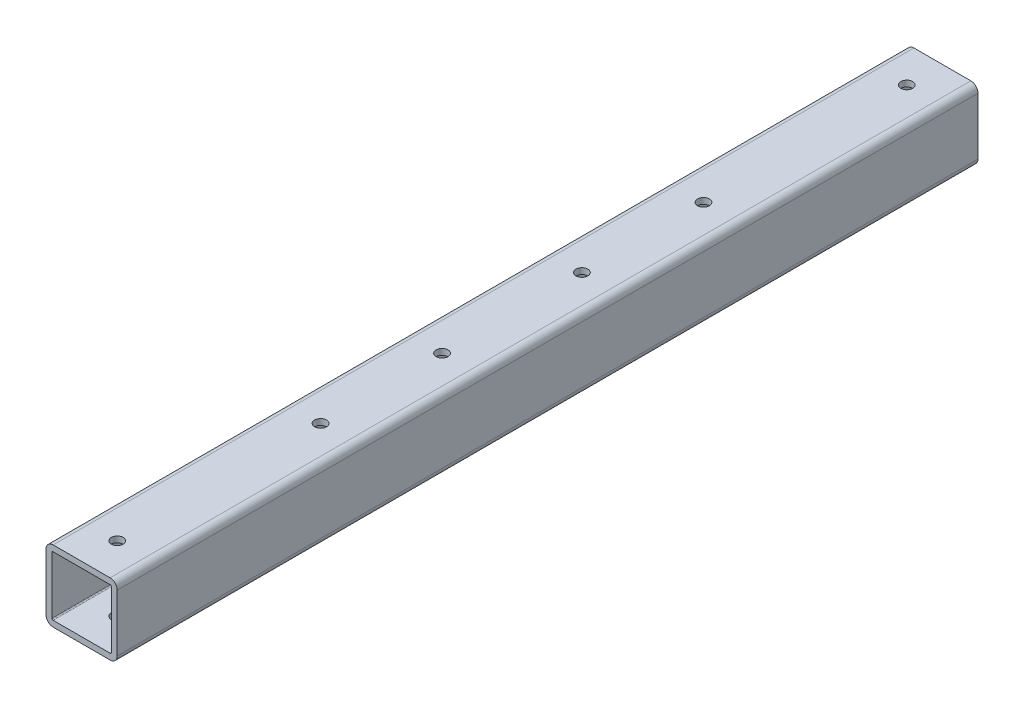
ISO-10303-21;
HEADER;
FILE_DESCRIPTION(('STEP AP214'),'2;1');
FILE_NAME('part.step','',(''),(''),'','','');
FILE_SCHEMA(('AUTOMOTIVE_DESIGN { 1 0 10303 214 1 1 1 1 }'));
ENDSEC;
DATA;
#1=APPLICATION_CONTEXT('core data for automotive mechanical design processes');
#2=APPLICATION_PROTOCOL_DEFINITION('international standard','automotive_design',2000,#1);
#3=PRODUCT_CONTEXT('',#1,'mechanical');
#4=PRODUCT('Part','Part','',(#3));
#5=PRODUCT_RELATED_PRODUCT_CATEGORY('part','',(#4));
#6=PRODUCT_DEFINITION_FORMATION('','',#4);
#7=PRODUCT_DEFINITION_CONTEXT('part definition',#1,'design');
#8=PRODUCT_DEFINITION('design','',#6,#7);
#9=PRODUCT_DEFINITION_SHAPE('','',#8);
#10=(LENGTH_UNIT() NAMED_UNIT(*) SI_UNIT(.MILLI.,.METRE.));
#11=(NAMED_UNIT(*) PLANE_ANGLE_UNIT() SI_UNIT($,.RADIAN.));
#12=(NAMED_UNIT(*) SI_UNIT($,.STERADIAN.) SOLID_ANGLE_UNIT());
#13=UNCERTAINTY_MEASURE_WITH_UNIT(LENGTH_MEASURE(1.E-05),#10,'distance_accuracy_value','');
#14=(GEOMETRIC_REPRESENTATION_CONTEXT(3) GLOBAL_UNCERTAINTY_ASSIGNED_CONTEXT((#13)) GLOBAL_UNIT_ASSIGNED_CONTEXT((#10,
#11,#12)) REPRESENTATION_CONTEXT('',''));
#15=CARTESIAN_POINT('',(0.,0.,0.));
#16=DIRECTION('',(0.,0.,1.));
#17=DIRECTION('',(1.,0.,0.));
#18=AXIS2_PLACEMENT_3D('',#15,#16,#17);
#19=CARTESIAN_POINT('',(0.,0.,230.1875));
#20=DIRECTION('',(0.,0.,1.));
#21=DIRECTION('',(1.,0.,0.));
#22=AXIS2_PLACEMENT_3D('',#19,#20,#21);
#23=PLANE('',#22);
#24=DIRECTION('',(0.,1.,0.));
#25=VECTOR('',#24,1.);
#26=CARTESIAN_POINT('',(19.05,19.05,230.1875));
#27=LINE('',#26,#25);
#28=CARTESIAN_POINT('',(19.05,-15.24,230.1875));
#29=VERTEX_POINT('',#28);
#30=CARTESIAN_POINT('',(19.05,15.24,230.1875));
#31=VERTEX_POINT('',#30);
#32=EDGE_CURVE('E207',#29,#31,#27,.T.);
#33=ORIENTED_EDGE('',*,*,#32,.T.);
#34=CARTESIAN_POINT('',(15.24,15.24,230.1875));
#35=DIRECTION('',(0.,0.,1.));
#36=DIRECTION('',(1.,0.,0.));
#37=AXIS2_PLACEMENT_3D('',#34,#35,#36);
#38=CIRCLE('',#37,3.81);
#39=CARTESIAN_POINT('',(15.24,19.05,230.1875));
#40=VERTEX_POINT('',#39);
#41=EDGE_CURVE('E232',#31,#40,#38,.T.);
#42=ORIENTED_EDGE('',*,*,#41,.T.);
#43=DIRECTION('',(-1.,0.,0.));
#44=VECTOR('',#43,1.);
#45=CARTESIAN_POINT('',(-19.05,19.05,230.1875));
#46=LINE('',#45,#44);
#47=CARTESIAN_POINT('',(-15.24,19.05,230.1875));
#48=VERTEX_POINT('',#47);
#49=EDGE_CURVE('E183',#40,#48,#46,.T.);
#50=ORIENTED_EDGE('',*,*,#49,.T.);
#51=CARTESIAN_POINT('',(-15.24,15.24,230.1875));
#52=DIRECTION('',(0.,0.,1.));
#53=DIRECTION('',(1.,0.,0.));
#54=AXIS2_PLACEMENT_3D('',#51,#52,#53);
#55=CIRCLE('',#54,3.81);
#56=CARTESIAN_POINT('',(-19.05,15.24,230.1875));
#57=VERTEX_POINT('',#56);
#58=EDGE_CURVE('E229',#48,#57,#55,.T.);
#59=ORIENTED_EDGE('',*,*,#58,.T.);
#60=DIRECTION('',(0.,-1.,0.));
#61=VECTOR('',#60,1.);
#62=CARTESIAN_POINT('',(-19.05,19.05,230.1875));
#63=LINE('',#62,#61);
#64=CARTESIAN_POINT('',(-19.05,-15.24,230.1875));
#65=VERTEX_POINT('',#64);
#66=EDGE_CURVE('E371',#57,#65,#63,.T.);
#67=ORIENTED_EDGE('',*,*,#66,.T.);
#68=CARTESIAN_POINT('',(-15.24,-15.24,230.1875));
#69=DIRECTION('',(0.,0.,1.));
#70=DIRECTION('',(1.,0.,0.));
#71=AXIS2_PLACEMENT_3D('',#68,#69,#70);
#72=CIRCLE('',#71,3.81);
#73=CARTESIAN_POINT('',(-15.24,-19.05,230.1875));
#74=VERTEX_POINT('',#73);
#75=EDGE_CURVE('E226',#65,#74,#72,.T.);
#76=ORIENTED_EDGE('',*,*,#75,.T.);
#77=DIRECTION('',(1.,0.,0.));
#78=VECTOR('',#77,1.);
#79=CARTESIAN_POINT('',(-19.05,-19.05,230.1875));
#80=LINE('',#79,#78);
#81=CARTESIAN_POINT('',(15.24,-19.05,230.1875));
#82=VERTEX_POINT('',#81);
#83=EDGE_CURVE('E209',#74,#82,#80,.T.);
#84=ORIENTED_EDGE('',*,*,#83,.T.);
#85=CARTESIAN_POINT('',(15.24,-15.24,230.1875));
#86=DIRECTION('',(0.,0.,1.));
#87=DIRECTION('',(1.,0.,0.));
#88=AXIS2_PLACEMENT_3D('',#85,#86,#87);
#89=CIRCLE('',#88,3.81);
#90=EDGE_CURVE('E223',#82,#29,#89,.T.);
#91=ORIENTED_EDGE('',*,*,#90,.T.);
#92=EDGE_LOOP('',(#33,#42,#50,#59,#67,#76,#84,#91));
#93=FACE_BOUND('',#92,.T.);
#94=DIRECTION('',(0.,-1.,0.));
#95=VECTOR('',#94,1.);
#96=CARTESIAN_POINT('',(-15.875,15.875,230.1875));
#97=LINE('',#96,#95);
#98=CARTESIAN_POINT('',(-15.875,15.24,230.1875));
#99=VERTEX_POINT('',#98);
#100=CARTESIAN_POINT('',(-15.875,-15.24,230.1875));
#101=VERTEX_POINT('',#100);
#102=EDGE_CURVE('E340',#99,#101,#97,.T.);
#103=ORIENTED_EDGE('',*,*,#102,.F.);
#104=CARTESIAN_POINT('',(-15.24,15.24,230.1875));
#105=DIRECTION('',(0.,0.,1.));
#106=DIRECTION('',(1.,0.,0.));
#107=AXIS2_PLACEMENT_3D('',#104,#105,#106);
#108=CIRCLE('',#107,0.635);
#109=CARTESIAN_POINT('',(-15.24,15.875,230.1875));
#110=VERTEX_POINT('',#109);
#111=EDGE_CURVE('E63',#99,#110,#108,.F.);
#112=ORIENTED_EDGE('',*,*,#111,.T.);
#113=DIRECTION('',(-1.,0.,0.));
#114=VECTOR('',#113,1.);
#115=CARTESIAN_POINT('',(-15.875,15.875,230.1875));
#116=LINE('',#115,#114);
#117=CARTESIAN_POINT('',(15.24,15.875,230.1875));
#118=VERTEX_POINT('',#117);
#119=EDGE_CURVE('E337',#118,#110,#116,.T.);
#120=ORIENTED_EDGE('',*,*,#119,.F.);
#121=CARTESIAN_POINT('',(15.24,15.24,230.1875));
#122=DIRECTION('',(0.,0.,1.));
#123=DIRECTION('',(1.,0.,0.));
#124=AXIS2_PLACEMENT_3D('',#121,#122,#123);
#125=CIRCLE('',#124,0.635);
#126=CARTESIAN_POINT('',(15.875,15.24,230.1875));
#127=VERTEX_POINT('',#126);
#128=EDGE_CURVE('E11',#118,#127,#125,.F.);
#129=ORIENTED_EDGE('',*,*,#128,.T.);
#130=DIRECTION('',(0.,1.,0.));
#131=VECTOR('',#130,1.);
#132=CARTESIAN_POINT('',(15.875,15.875,230.1875));
#133=LINE('',#132,#131);
#134=CARTESIAN_POINT('',(15.875,-15.24,230.1875));
#135=VERTEX_POINT('',#134);
#136=EDGE_CURVE('E200',#135,#127,#133,.T.);
#137=ORIENTED_EDGE('',*,*,#136,.F.);
#138=CARTESIAN_POINT('',(15.24,-15.24,230.1875));
#139=DIRECTION('',(0.,0.,1.));
#140=DIRECTION('',(1.,0.,0.));
#141=AXIS2_PLACEMENT_3D('',#138,#139,#140);
#142=CIRCLE('',#141,0.635);
#143=CARTESIAN_POINT('',(15.24,-15.875,230.1875));
#144=VERTEX_POINT('',#143);
#145=EDGE_CURVE('E279',#135,#144,#142,.F.);
#146=ORIENTED_EDGE('',*,*,#145,.T.);
#147=DIRECTION('',(1.,0.,0.));
#148=VECTOR('',#147,1.);
#149=CARTESIAN_POINT('',(-15.875,-15.875,230.1875));
#150=LINE('',#149,#148);
#151=CARTESIAN_POINT('',(-15.24,-15.875,230.1875));
#152=VERTEX_POINT('',#151);
#153=EDGE_CURVE('E345',#152,#144,#150,.T.);
#154=ORIENTED_EDGE('',*,*,#153,.F.);
#155=CARTESIAN_POINT('',(-15.24,-15.24,230.1875));
#156=DIRECTION('',(0.,0.,1.));
#157=DIRECTION('',(1.,0.,0.));
#158=AXIS2_PLACEMENT_3D('',#155,#156,#157);
#159=CIRCLE('',#158,0.635);
#160=EDGE_CURVE('E285',#152,#101,#159,.F.);
#161=ORIENTED_EDGE('',*,*,#160,.T.);
#162=EDGE_LOOP('',(#103,#112,#120,#129,#137,#146,#154,#161));
#163=FACE_BOUND('',#162,.T.);
#164=ADVANCED_FACE('F45',(#93,#163),#23,.T.);
#165=CARTESIAN_POINT('',(0.,0.,-230.1875));
#166=DIRECTION('',(0.,0.,1.));
#167=DIRECTION('',(1.,0.,0.));
#168=AXIS2_PLACEMENT_3D('',#165,#166,#167);
#169=PLANE('',#168);
#170=DIRECTION('',(-1.,0.,0.));
#171=VECTOR('',#170,1.);
#172=CARTESIAN_POINT('',(-19.05,19.05,-230.1875));
#173=LINE('',#172,#171);
#174=CARTESIAN_POINT('',(15.24,19.05,-230.1875));
#175=VERTEX_POINT('',#174);
#176=CARTESIAN_POINT('',(-15.24,19.05,-230.1875));
#177=VERTEX_POINT('',#176);
#178=EDGE_CURVE('E180',#175,#177,#173,.T.);
#179=ORIENTED_EDGE('',*,*,#178,.F.);
#180=CARTESIAN_POINT('',(15.24,15.24,-230.1875));
#181=DIRECTION('',(0.,0.,1.));
#182=DIRECTION('',(1.,0.,0.));
#183=AXIS2_PLACEMENT_3D('',#180,#181,#182);
#184=CIRCLE('',#183,3.81);
#185=CARTESIAN_POINT('',(19.05,15.24,-230.1875));
#186=VERTEX_POINT('',#185);
#187=EDGE_CURVE('E162',#175,#186,#184,.F.);
#188=ORIENTED_EDGE('',*,*,#187,.T.);
#189=DIRECTION('',(0.,1.,0.));
#190=VECTOR('',#189,1.);
#191=CARTESIAN_POINT('',(19.05,19.05,-230.1875));
#192=LINE('',#191,#190);
#193=CARTESIAN_POINT('',(19.05,-15.24,-230.1875));
#194=VERTEX_POINT('',#193);
#195=EDGE_CURVE('E193',#194,#186,#192,.T.);
#196=ORIENTED_EDGE('',*,*,#195,.F.);
#197=CARTESIAN_POINT('',(15.24,-15.24,-230.1875));
#198=DIRECTION('',(0.,0.,1.));
#199=DIRECTION('',(1.,0.,0.));
#200=AXIS2_PLACEMENT_3D('',#197,#198,#199);
#201=CIRCLE('',#200,3.81);
#202=CARTESIAN_POINT('',(15.24,-19.05,-230.1875));
#203=VERTEX_POINT('',#202);
#204=EDGE_CURVE('E185',#194,#203,#201,.F.);
#205=ORIENTED_EDGE('',*,*,#204,.T.);
#206=DIRECTION('',(1.,0.,0.));
#207=VECTOR('',#206,1.);
#208=CARTESIAN_POINT('',(-19.05,-19.05,-230.1875));
#209=LINE('',#208,#207);
#210=CARTESIAN_POINT('',(-15.24,-19.05,-230.1875));
#211=VERTEX_POINT('',#210);
#212=EDGE_CURVE('E198',#211,#203,#209,.T.);
#213=ORIENTED_EDGE('',*,*,#212,.F.);
#214=CARTESIAN_POINT('',(-15.24,-15.24,-230.1875));
#215=DIRECTION('',(0.,0.,1.));
#216=DIRECTION('',(1.,0.,0.));
#217=AXIS2_PLACEMENT_3D('',#214,#215,#216);
#218=CIRCLE('',#217,3.81);
#219=CARTESIAN_POINT('',(-19.05,-15.24,-230.1875));
#220=VERTEX_POINT('',#219);
#221=EDGE_CURVE('E213',#211,#220,#218,.F.);
#222=ORIENTED_EDGE('',*,*,#221,.T.);
#223=DIRECTION('',(0.,-1.,0.));
#224=VECTOR('',#223,1.);
#225=CARTESIAN_POINT('',(-19.05,19.05,-230.1875));
#226=LINE('',#225,#224);
#227=CARTESIAN_POINT('',(-19.05,15.24,-230.1875));
#228=VERTEX_POINT('',#227);
#229=EDGE_CURVE('E192',#228,#220,#226,.T.);
#230=ORIENTED_EDGE('',*,*,#229,.F.);
#231=CARTESIAN_POINT('',(-15.24,15.24,-230.1875));
#232=DIRECTION('',(0.,0.,1.));
#233=DIRECTION('',(1.,0.,0.));
#234=AXIS2_PLACEMENT_3D('',#231,#232,#233);
#235=CIRCLE('',#234,3.81);
#236=EDGE_CURVE('E174',#228,#177,#235,.F.);
#237=ORIENTED_EDGE('',*,*,#236,.T.);
#238=EDGE_LOOP('',(#179,#188,#196,#205,#213,#222,#230,#237));
#239=FACE_BOUND('',#238,.T.);
#240=DIRECTION('',(0.,1.,0.));
#241=VECTOR('',#240,1.);
#242=CARTESIAN_POINT('',(15.875,15.875,-230.1875));
#243=LINE('',#242,#241);
#244=CARTESIAN_POINT('',(15.875,-15.24,-230.1875));
#245=VERTEX_POINT('',#244);
#246=CARTESIAN_POINT('',(15.875,15.24,-230.1875));
#247=VERTEX_POINT('',#246);
#248=EDGE_CURVE('E341',#245,#247,#243,.T.);
#249=ORIENTED_EDGE('',*,*,#248,.T.);
#250=CARTESIAN_POINT('',(15.24,15.24,-230.1875));
#251=DIRECTION('',(0.,0.,1.));
#252=DIRECTION('',(1.,0.,0.));
#253=AXIS2_PLACEMENT_3D('',#250,#251,#252);
#254=CIRCLE('',#253,0.635);
#255=CARTESIAN_POINT('',(15.24,15.875,-230.1875));
#256=VERTEX_POINT('',#255);
#257=EDGE_CURVE('E55',#247,#256,#254,.T.);
#258=ORIENTED_EDGE('',*,*,#257,.T.);
#259=DIRECTION('',(-1.,0.,0.));
#260=VECTOR('',#259,1.);
#261=CARTESIAN_POINT('',(-15.875,15.875,-230.1875));
#262=LINE('',#261,#260);
#263=CARTESIAN_POINT('',(-15.24,15.875,-230.1875));
#264=VERTEX_POINT('',#263);
#265=EDGE_CURVE('E336',#256,#264,#262,.T.);
#266=ORIENTED_EDGE('',*,*,#265,.T.);
#267=CARTESIAN_POINT('',(-15.24,15.24,-230.1875));
#268=DIRECTION('',(0.,0.,1.));
#269=DIRECTION('',(1.,0.,0.));
#270=AXIS2_PLACEMENT_3D('',#267,#268,#269);
#271=CIRCLE('',#270,0.635);
#272=CARTESIAN_POINT('',(-15.875,15.24,-230.1875));
#273=VERTEX_POINT('',#272);
#274=EDGE_CURVE('E288',#264,#273,#271,.T.);
#275=ORIENTED_EDGE('',*,*,#274,.T.);
#276=DIRECTION('',(0.,-1.,0.));
#277=VECTOR('',#276,1.);
#278=CARTESIAN_POINT('',(-15.875,15.875,-230.1875));
#279=LINE('',#278,#277);
#280=CARTESIAN_POINT('',(-15.875,-15.24,-230.1875));
#281=VERTEX_POINT('',#280);
#282=EDGE_CURVE('E355',#273,#281,#279,.T.);
#283=ORIENTED_EDGE('',*,*,#282,.T.);
#284=CARTESIAN_POINT('',(-15.24,-15.24,-230.1875));
#285=DIRECTION('',(0.,0.,1.));
#286=DIRECTION('',(1.,0.,0.));
#287=AXIS2_PLACEMENT_3D('',#284,#285,#286);
#288=CIRCLE('',#287,0.635);
#289=CARTESIAN_POINT('',(-15.24,-15.875,-230.1875));
#290=VERTEX_POINT('',#289);
#291=EDGE_CURVE('E282',#281,#290,#288,.T.);
#292=ORIENTED_EDGE('',*,*,#291,.T.);
#293=DIRECTION('',(1.,0.,0.));
#294=VECTOR('',#293,1.);
#295=CARTESIAN_POINT('',(-15.875,-15.875,-230.1875));
#296=LINE('',#295,#294);
#297=CARTESIAN_POINT('',(15.24,-15.875,-230.1875));
#298=VERTEX_POINT('',#297);
#299=EDGE_CURVE('E359',#290,#298,#296,.T.);
#300=ORIENTED_EDGE('',*,*,#299,.T.);
#301=CARTESIAN_POINT('',(15.24,-15.24,-230.1875));
#302=DIRECTION('',(0.,0.,1.));
#303=DIRECTION('',(1.,0.,0.));
#304=AXIS2_PLACEMENT_3D('',#301,#302,#303);
#305=CIRCLE('',#304,0.635);
#306=EDGE_CURVE('E276',#298,#245,#305,.T.);
#307=ORIENTED_EDGE('',*,*,#306,.T.);
#308=EDGE_LOOP('',(#249,#258,#266,#275,#283,#292,#300,#307));
#309=FACE_BOUND('',#308,.T.);
#310=ADVANCED_FACE('F188',(#239,#309),#169,.F.);
#311=CARTESIAN_POINT('',(19.05,19.05,230.1875));
#312=DIRECTION('',(-1.,0.,0.));
#313=DIRECTION('',(0.,0.,1.));
#314=AXIS2_PLACEMENT_3D('',#311,#312,#313);
#315=PLANE('',#314);
#316=ORIENTED_EDGE('',*,*,#195,.T.);
#317=DIRECTION('',(0.,0.,-1.));
#318=VECTOR('',#317,1.);
#319=CARTESIAN_POINT('',(19.05,15.24,230.1875));
#320=LINE('',#319,#318);
#321=EDGE_CURVE('E167',#186,#31,#320,.F.);
#322=ORIENTED_EDGE('',*,*,#321,.T.);
#323=ORIENTED_EDGE('',*,*,#32,.F.);
#324=DIRECTION('',(0.,0.,-1.));
#325=VECTOR('',#324,1.);
#326=CARTESIAN_POINT('',(19.05,-15.24,230.1875));
#327=LINE('',#326,#325);
#328=EDGE_CURVE('E173',#29,#194,#327,.T.);
#329=ORIENTED_EDGE('',*,*,#328,.T.);
#330=EDGE_LOOP('',(#316,#322,#323,#329));
#331=FACE_BOUND('',#330,.T.);
#332=ADVANCED_FACE('F388',(#331),#315,.F.);
#333=CARTESIAN_POINT('',(-19.05,19.05,230.1875));
#334=DIRECTION('',(0.,-1.,0.));
#335=DIRECTION('',(0.,0.,-1.));
#336=AXIS2_PLACEMENT_3D('',#333,#334,#335);
#337=PLANE('',#336);
#338=CARTESIAN_POINT('',(0.,19.05,211.1375));
#339=DIRECTION('',(0.,1.,0.));
#340=DIRECTION('',(0.,0.,1.));
#341=AXIS2_PLACEMENT_3D('',#338,#339,#340);
#342=CIRCLE('',#341,3.175);
#343=CARTESIAN_POINT('',(0.,19.05,214.3125));
#344=VERTEX_POINT('',#343);
#345=EDGE_CURVE('E716',#344,#344,#342,.T.);
#346=ORIENTED_EDGE('',*,*,#345,.F.);
#347=EDGE_LOOP('',(#346));
#348=FACE_BOUND('',#347,.T.);
#349=CARTESIAN_POINT('',(0.,19.05,102.4));
#350=DIRECTION('',(0.,1.,0.));
#351=DIRECTION('',(0.,0.,1.));
#352=AXIS2_PLACEMENT_3D('',#349,#350,#351);
#353=CIRCLE('',#352,3.175);
#354=CARTESIAN_POINT('',(0.,19.05,105.575));
#355=VERTEX_POINT('',#354);
#356=EDGE_CURVE('E712',#355,#355,#353,.T.);
#357=ORIENTED_EDGE('',*,*,#356,.F.);
#358=EDGE_LOOP('',(#357));
#359=FACE_BOUND('',#358,.T.);
#360=CARTESIAN_POINT('',(0.,19.05,37.4));
#361=DIRECTION('',(0.,1.,0.));
#362=DIRECTION('',(0.,0.,1.));
#363=AXIS2_PLACEMENT_3D('',#360,#361,#362);
#364=CIRCLE('',#363,3.175);
#365=CARTESIAN_POINT('',(0.,19.05,40.575));
#366=VERTEX_POINT('',#365);
#367=EDGE_CURVE('E704',#366,#366,#364,.T.);
#368=ORIENTED_EDGE('',*,*,#367,.F.);
#369=EDGE_LOOP('',(#368));
#370=FACE_BOUND('',#369,.T.);
#371=CARTESIAN_POINT('',(0.,19.05,-37.4));
#372=DIRECTION('',(0.,1.,0.));
#373=DIRECTION('',(0.,0.,1.));
#374=AXIS2_PLACEMENT_3D('',#371,#372,#373);
#375=CIRCLE('',#374,3.175);
#376=CARTESIAN_POINT('',(0.,19.05,-34.225));
#377=VERTEX_POINT('',#376);
#378=EDGE_CURVE('E684',#377,#377,#375,.T.);
#379=ORIENTED_EDGE('',*,*,#378,.F.);
#380=EDGE_LOOP('',(#379));
#381=FACE_BOUND('',#380,.T.);
#382=CARTESIAN_POINT('',(0.,19.05,-102.4));
#383=DIRECTION('',(0.,1.,0.));
#384=DIRECTION('',(0.,0.,1.));
#385=AXIS2_PLACEMENT_3D('',#382,#383,#384);
#386=CIRCLE('',#385,3.175);
#387=CARTESIAN_POINT('',(0.,19.05,-99.225));
#388=VERTEX_POINT('',#387);
#389=EDGE_CURVE('E675',#388,#388,#386,.T.);
#390=ORIENTED_EDGE('',*,*,#389,.F.);
#391=EDGE_LOOP('',(#390));
#392=FACE_BOUND('',#391,.T.);
#393=CARTESIAN_POINT('',(0.,19.05,-211.1375));
#394=DIRECTION('',(0.,1.,0.));
#395=DIRECTION('',(0.,0.,1.));
#396=AXIS2_PLACEMENT_3D('',#393,#394,#395);
#397=CIRCLE('',#396,3.175);
#398=CARTESIAN_POINT('',(0.,19.05,-207.9625));
#399=VERTEX_POINT('',#398);
#400=EDGE_CURVE('E669',#399,#399,#397,.T.);
#401=ORIENTED_EDGE('',*,*,#400,.F.);
#402=EDGE_LOOP('',(#401));
#403=FACE_BOUND('',#402,.T.);
#404=ORIENTED_EDGE('',*,*,#49,.F.);
#405=DIRECTION('',(0.,0.,-1.));
#406=VECTOR('',#405,1.);
#407=CARTESIAN_POINT('',(15.24,19.05,230.1875));
#408=LINE('',#407,#406);
#409=EDGE_CURVE('E166',#40,#175,#408,.T.);
#410=ORIENTED_EDGE('',*,*,#409,.T.);
#411=ORIENTED_EDGE('',*,*,#178,.T.);
#412=DIRECTION('',(0.,0.,-1.));
#413=VECTOR('',#412,1.);
#414=CARTESIAN_POINT('',(-15.24,19.05,230.1875));
#415=LINE('',#414,#413);
#416=EDGE_CURVE('E186',#177,#48,#415,.F.);
#417=ORIENTED_EDGE('',*,*,#416,.T.);
#418=EDGE_LOOP('',(#404,#410,#411,#417));
#419=FACE_BOUND('',#418,.T.);
#420=ADVANCED_FACE('F179',(#348,#359,#370,#381,#392,#403,#419),#337,.F.);
#421=CARTESIAN_POINT('',(-19.05,19.05,230.1875));
#422=DIRECTION('',(1.,0.,0.));
#423=DIRECTION('',(0.,0.,-1.));
#424=AXIS2_PLACEMENT_3D('',#421,#422,#423);
#425=PLANE('',#424);
#426=ORIENTED_EDGE('',*,*,#66,.F.);
#427=DIRECTION('',(0.,0.,-1.));
#428=VECTOR('',#427,1.);
#429=CARTESIAN_POINT('',(-19.05,15.24,230.1875));
#430=LINE('',#429,#428);
#431=EDGE_CURVE('E238',#57,#228,#430,.T.);
#432=ORIENTED_EDGE('',*,*,#431,.T.);
#433=ORIENTED_EDGE('',*,*,#229,.T.);
#434=DIRECTION('',(0.,0.,-1.));
#435=VECTOR('',#434,1.);
#436=CARTESIAN_POINT('',(-19.05,-15.24,230.1875));
#437=LINE('',#436,#435);
#438=EDGE_CURVE('E235',#220,#65,#437,.F.);
#439=ORIENTED_EDGE('',*,*,#438,.T.);
#440=EDGE_LOOP('',(#426,#432,#433,#439));
#441=FACE_BOUND('',#440,.T.);
#442=ADVANCED_FACE('F396',(#441),#425,.F.);
#443=CARTESIAN_POINT('',(-19.05,-19.05,230.1875));
#444=DIRECTION('',(0.,1.,0.));
#445=DIRECTION('',(0.,0.,1.));
#446=AXIS2_PLACEMENT_3D('',#443,#444,#445);
#447=PLANE('',#446);
#448=CARTESIAN_POINT('',(0.,-19.05,211.1375));
#449=DIRECTION('',(0.,1.,0.));
#450=DIRECTION('',(0.,0.,1.));
#451=AXIS2_PLACEMENT_3D('',#448,#449,#450);
#452=CIRCLE('',#451,3.175);
#453=CARTESIAN_POINT('',(0.,-19.05,214.3125));
#454=VERTEX_POINT('',#453);
#455=EDGE_CURVE('E300',#454,#454,#452,.T.);
#456=ORIENTED_EDGE('',*,*,#455,.T.);
#457=EDGE_LOOP('',(#456));
#458=FACE_BOUND('',#457,.T.);
#459=CARTESIAN_POINT('',(0.,-19.05,102.4));
#460=DIRECTION('',(0.,1.,0.));
#461=DIRECTION('',(0.,0.,1.));
#462=AXIS2_PLACEMENT_3D('',#459,#460,#461);
#463=CIRCLE('',#462,3.175);
#464=CARTESIAN_POINT('',(0.,-19.05,105.575));
#465=VERTEX_POINT('',#464);
#466=EDGE_CURVE('E708',#465,#465,#463,.T.);
#467=ORIENTED_EDGE('',*,*,#466,.T.);
#468=EDGE_LOOP('',(#467));
#469=FACE_BOUND('',#468,.T.);
#470=CARTESIAN_POINT('',(0.,-19.05,37.4));
#471=DIRECTION('',(0.,1.,0.));
#472=DIRECTION('',(0.,0.,1.));
#473=AXIS2_PLACEMENT_3D('',#470,#471,#472);
#474=CIRCLE('',#473,3.175);
#475=CARTESIAN_POINT('',(0.,-19.05,40.575));
#476=VERTEX_POINT('',#475);
#477=EDGE_CURVE('E702',#476,#476,#474,.T.);
#478=ORIENTED_EDGE('',*,*,#477,.T.);
#479=EDGE_LOOP('',(#478));
#480=FACE_BOUND('',#479,.T.);
#481=CARTESIAN_POINT('',(0.,-19.05,-37.4));
#482=DIRECTION('',(0.,1.,0.));
#483=DIRECTION('',(0.,0.,1.));
#484=AXIS2_PLACEMENT_3D('',#481,#482,#483);
#485=CIRCLE('',#484,3.175);
#486=CARTESIAN_POINT('',(0.,-19.05,-34.225));
#487=VERTEX_POINT('',#486);
#488=EDGE_CURVE('E678',#487,#487,#485,.T.);
#489=ORIENTED_EDGE('',*,*,#488,.T.);
#490=EDGE_LOOP('',(#489));
#491=FACE_BOUND('',#490,.T.);
#492=CARTESIAN_POINT('',(0.,-19.05,-102.4));
#493=DIRECTION('',(0.,1.,0.));
#494=DIRECTION('',(0.,0.,1.));
#495=AXIS2_PLACEMENT_3D('',#492,#493,#494);
#496=CIRCLE('',#495,3.175);
#497=CARTESIAN_POINT('',(0.,-19.05,-99.225));
#498=VERTEX_POINT('',#497);
#499=EDGE_CURVE('E679',#498,#498,#496,.T.);
#500=ORIENTED_EDGE('',*,*,#499,.T.);
#501=EDGE_LOOP('',(#500));
#502=FACE_BOUND('',#501,.T.);
#503=CARTESIAN_POINT('',(0.,-19.05,-211.1375));
#504=DIRECTION('',(0.,1.,0.));
#505=DIRECTION('',(0.,0.,1.));
#506=AXIS2_PLACEMENT_3D('',#503,#504,#505);
#507=CIRCLE('',#506,3.175);
#508=CARTESIAN_POINT('',(0.,-19.05,-207.9625));
#509=VERTEX_POINT('',#508);
#510=EDGE_CURVE('E689',#509,#509,#507,.T.);
#511=ORIENTED_EDGE('',*,*,#510,.T.);
#512=EDGE_LOOP('',(#511));
#513=FACE_BOUND('',#512,.T.);
#514=ORIENTED_EDGE('',*,*,#83,.F.);
#515=DIRECTION('',(0.,0.,-1.));
#516=VECTOR('',#515,1.);
#517=CARTESIAN_POINT('',(-15.24,-19.05,230.1875));
#518=LINE('',#517,#516);
#519=EDGE_CURVE('E245',#74,#211,#518,.T.);
#520=ORIENTED_EDGE('',*,*,#519,.T.);
#521=ORIENTED_EDGE('',*,*,#212,.T.);
#522=DIRECTION('',(0.,0.,-1.));
#523=VECTOR('',#522,1.);
#524=CARTESIAN_POINT('',(15.24,-19.05,230.1875));
#525=LINE('',#524,#523);
#526=EDGE_CURVE('E242',#203,#82,#525,.F.);
#527=ORIENTED_EDGE('',*,*,#526,.T.);
#528=EDGE_LOOP('',(#514,#520,#521,#527));
#529=FACE_BOUND('',#528,.T.);
#530=ADVANCED_FACE('F390',(#458,#469,#480,#491,#502,#513,#529),#447,.F.);
#531=CARTESIAN_POINT('',(-15.875,15.875,230.1875));
#532=DIRECTION('',(0.,-1.,0.));
#533=DIRECTION('',(1.,0.,0.));
#534=AXIS2_PLACEMENT_3D('',#531,#532,#533);
#535=PLANE('',#534);
#536=CARTESIAN_POINT('',(0.,15.875,211.1375));
#537=DIRECTION('',(0.,-1.,0.));
#538=DIRECTION('',(1.,0.,0.));
#539=AXIS2_PLACEMENT_3D('',#536,#537,#538);
#540=CIRCLE('',#539,3.175);
#541=CARTESIAN_POINT('',(3.175,15.875,211.1375));
#542=VERTEX_POINT('',#541);
#543=EDGE_CURVE('E332',#542,#542,#540,.T.);
#544=ORIENTED_EDGE('',*,*,#543,.F.);
#545=EDGE_LOOP('',(#544));
#546=FACE_BOUND('',#545,.T.);
#547=CARTESIAN_POINT('',(0.,15.875,102.4));
#548=DIRECTION('',(0.,-1.,0.));
#549=DIRECTION('',(1.,0.,0.));
#550=AXIS2_PLACEMENT_3D('',#547,#548,#549);
#551=CIRCLE('',#550,3.175);
#552=CARTESIAN_POINT('',(3.175,15.875,102.4));
#553=VERTEX_POINT('',#552);
#554=EDGE_CURVE('E318',#553,#553,#551,.T.);
#555=ORIENTED_EDGE('',*,*,#554,.F.);
#556=EDGE_LOOP('',(#555));
#557=FACE_BOUND('',#556,.T.);
#558=CARTESIAN_POINT('',(0.,15.875,37.4));
#559=DIRECTION('',(0.,-1.,0.));
#560=DIRECTION('',(1.,0.,0.));
#561=AXIS2_PLACEMENT_3D('',#558,#559,#560);
#562=CIRCLE('',#561,3.175);
#563=CARTESIAN_POINT('',(3.175,15.875,37.4));
#564=VERTEX_POINT('',#563);
#565=EDGE_CURVE('E314',#564,#564,#562,.T.);
#566=ORIENTED_EDGE('',*,*,#565,.F.);
#567=EDGE_LOOP('',(#566));
#568=FACE_BOUND('',#567,.T.);
#569=CARTESIAN_POINT('',(0.,15.875,-37.4));
#570=DIRECTION('',(0.,-1.,0.));
#571=DIRECTION('',(1.,0.,0.));
#572=AXIS2_PLACEMENT_3D('',#569,#570,#571);
#573=CIRCLE('',#572,3.175);
#574=CARTESIAN_POINT('',(3.175,15.875,-37.4));
#575=VERTEX_POINT('',#574);
#576=EDGE_CURVE('E310',#575,#575,#573,.T.);
#577=ORIENTED_EDGE('',*,*,#576,.F.);
#578=EDGE_LOOP('',(#577));
#579=FACE_BOUND('',#578,.T.);
#580=CARTESIAN_POINT('',(0.,15.875,-102.4));
#581=DIRECTION('',(0.,-1.,0.));
#582=DIRECTION('',(1.,0.,0.));
#583=AXIS2_PLACEMENT_3D('',#580,#581,#582);
#584=CIRCLE('',#583,3.175);
#585=CARTESIAN_POINT('',(3.175,15.875,-102.4));
#586=VERTEX_POINT('',#585);
#587=EDGE_CURVE('E305',#586,#586,#584,.T.);
#588=ORIENTED_EDGE('',*,*,#587,.F.);
#589=EDGE_LOOP('',(#588));
#590=FACE_BOUND('',#589,.T.);
#591=CARTESIAN_POINT('',(0.,15.875,-211.1375));
#592=DIRECTION('',(0.,-1.,0.));
#593=DIRECTION('',(1.,0.,0.));
#594=AXIS2_PLACEMENT_3D('',#591,#592,#593);
#595=CIRCLE('',#594,3.175);
#596=CARTESIAN_POINT('',(3.175,15.875,-211.1375));
#597=VERTEX_POINT('',#596);
#598=EDGE_CURVE('E299',#597,#597,#595,.T.);
#599=ORIENTED_EDGE('',*,*,#598,.F.);
#600=EDGE_LOOP('',(#599));
#601=FACE_BOUND('',#600,.T.);
#602=ORIENTED_EDGE('',*,*,#119,.T.);
#603=DIRECTION('',(0.,0.,-1.));
#604=VECTOR('',#603,1.);
#605=CARTESIAN_POINT('',(-15.24,15.875,-230.1875));
#606=LINE('',#605,#604);
#607=EDGE_CURVE('E272',#110,#264,#606,.T.);
#608=ORIENTED_EDGE('',*,*,#607,.T.);
#609=ORIENTED_EDGE('',*,*,#265,.F.);
#610=DIRECTION('',(0.,0.,-1.));
#611=VECTOR('',#610,1.);
#612=CARTESIAN_POINT('',(15.24,15.875,230.1875));
#613=LINE('',#612,#611);
#614=EDGE_CURVE('E70',#256,#118,#613,.F.);
#615=ORIENTED_EDGE('',*,*,#614,.T.);
#616=EDGE_LOOP('',(#602,#608,#609,#615));
#617=FACE_BOUND('',#616,.T.);
#618=ADVANCED_FACE('F418',(#546,#557,#568,#579,#590,#601,#617),#535,.T.);
#619=CARTESIAN_POINT('',(-15.875,15.875,230.1875));
#620=DIRECTION('',(1.,0.,0.));
#621=DIRECTION('',(0.,1.,0.));
#622=AXIS2_PLACEMENT_3D('',#619,#620,#621);
#623=PLANE('',#622);
#624=ORIENTED_EDGE('',*,*,#102,.T.);
#625=DIRECTION('',(0.,0.,-1.));
#626=VECTOR('',#625,1.);
#627=CARTESIAN_POINT('',(-15.875,-15.24,-230.1875));
#628=LINE('',#627,#626);
#629=EDGE_CURVE('E266',#101,#281,#628,.T.);
#630=ORIENTED_EDGE('',*,*,#629,.T.);
#631=ORIENTED_EDGE('',*,*,#282,.F.);
#632=DIRECTION('',(0.,0.,-1.));
#633=VECTOR('',#632,1.);
#634=CARTESIAN_POINT('',(-15.875,15.24,230.1875));
#635=LINE('',#634,#633);
#636=EDGE_CURVE('E263',#273,#99,#635,.F.);
#637=ORIENTED_EDGE('',*,*,#636,.T.);
#638=EDGE_LOOP('',(#624,#630,#631,#637));
#639=FACE_BOUND('',#638,.T.);
#640=ADVANCED_FACE('F627',(#639),#623,.T.);
#641=CARTESIAN_POINT('',(-15.875,-15.875,230.1875));
#642=DIRECTION('',(0.,1.,0.));
#643=DIRECTION('',(-1.,0.,0.));
#644=AXIS2_PLACEMENT_3D('',#641,#642,#643);
#645=PLANE('',#644);
#646=CARTESIAN_POINT('',(0.,-15.875,211.1375));
#647=DIRECTION('',(0.,1.,0.));
#648=DIRECTION('',(-1.,0.,0.));
#649=AXIS2_PLACEMENT_3D('',#646,#647,#648);
#650=CIRCLE('',#649,3.175);
#651=CARTESIAN_POINT('',(-3.175,-15.875,211.1375));
#652=VERTEX_POINT('',#651);
#653=EDGE_CURVE('E49',#652,#652,#650,.T.);
#654=ORIENTED_EDGE('',*,*,#653,.F.);
#655=EDGE_LOOP('',(#654));
#656=FACE_BOUND('',#655,.T.);
#657=CARTESIAN_POINT('',(0.,-15.875,102.4));
#658=DIRECTION('',(0.,1.,0.));
#659=DIRECTION('',(-1.,0.,0.));
#660=AXIS2_PLACEMENT_3D('',#657,#658,#659);
#661=CIRCLE('',#660,3.175);
#662=CARTESIAN_POINT('',(-3.175,-15.875,102.4));
#663=VERTEX_POINT('',#662);
#664=EDGE_CURVE('E315',#663,#663,#661,.T.);
#665=ORIENTED_EDGE('',*,*,#664,.F.);
#666=EDGE_LOOP('',(#665));
#667=FACE_BOUND('',#666,.T.);
#668=CARTESIAN_POINT('',(0.,-15.875,37.4));
#669=DIRECTION('',(0.,1.,0.));
#670=DIRECTION('',(-1.,0.,0.));
#671=AXIS2_PLACEMENT_3D('',#668,#669,#670);
#672=CIRCLE('',#671,3.175);
#673=CARTESIAN_POINT('',(-3.175,-15.875,37.4));
#674=VERTEX_POINT('',#673);
#675=EDGE_CURVE('E311',#674,#674,#672,.T.);
#676=ORIENTED_EDGE('',*,*,#675,.F.);
#677=EDGE_LOOP('',(#676));
#678=FACE_BOUND('',#677,.T.);
#679=CARTESIAN_POINT('',(0.,-15.875,-37.4));
#680=DIRECTION('',(0.,1.,0.));
#681=DIRECTION('',(-1.,0.,0.));
#682=AXIS2_PLACEMENT_3D('',#679,#680,#681);
#683=CIRCLE('',#682,3.175);
#684=CARTESIAN_POINT('',(-3.175,-15.875,-37.4));
#685=VERTEX_POINT('',#684);
#686=EDGE_CURVE('E306',#685,#685,#683,.T.);
#687=ORIENTED_EDGE('',*,*,#686,.F.);
#688=EDGE_LOOP('',(#687));
#689=FACE_BOUND('',#688,.T.);
#690=CARTESIAN_POINT('',(0.,-15.875,-102.4));
#691=DIRECTION('',(0.,1.,0.));
#692=DIRECTION('',(-1.,0.,0.));
#693=AXIS2_PLACEMENT_3D('',#690,#691,#692);
#694=CIRCLE('',#693,3.175);
#695=CARTESIAN_POINT('',(-3.175,-15.875,-102.4));
#696=VERTEX_POINT('',#695);
#697=EDGE_CURVE('E301',#696,#696,#694,.T.);
#698=ORIENTED_EDGE('',*,*,#697,.F.);
#699=EDGE_LOOP('',(#698));
#700=FACE_BOUND('',#699,.T.);
#701=CARTESIAN_POINT('',(0.,-15.875,-211.1375));
#702=DIRECTION('',(0.,1.,0.));
#703=DIRECTION('',(-1.,0.,0.));
#704=AXIS2_PLACEMENT_3D('',#701,#702,#703);
#705=CIRCLE('',#704,3.175);
#706=CARTESIAN_POINT('',(-3.175,-15.875,-211.1375));
#707=VERTEX_POINT('',#706);
#708=EDGE_CURVE('E295',#707,#707,#705,.T.);
#709=ORIENTED_EDGE('',*,*,#708,.F.);
#710=EDGE_LOOP('',(#709));
#711=FACE_BOUND('',#710,.T.);
#712=ORIENTED_EDGE('',*,*,#153,.T.);
#713=DIRECTION('',(0.,0.,-1.));
#714=VECTOR('',#713,1.);
#715=CARTESIAN_POINT('',(15.24,-15.875,-230.1875));
#716=LINE('',#715,#714);
#717=EDGE_CURVE('E252',#144,#298,#716,.T.);
#718=ORIENTED_EDGE('',*,*,#717,.T.);
#719=ORIENTED_EDGE('',*,*,#299,.F.);
#720=DIRECTION('',(0.,0.,-1.));
#721=VECTOR('',#720,1.);
#722=CARTESIAN_POINT('',(-15.24,-15.875,230.1875));
#723=LINE('',#722,#721);
#724=EDGE_CURVE('E249',#290,#152,#723,.F.);
#725=ORIENTED_EDGE('',*,*,#724,.T.);
#726=EDGE_LOOP('',(#712,#718,#719,#725));
#727=FACE_BOUND('',#726,.T.);
#728=ADVANCED_FACE('F625',(#656,#667,#678,#689,#700,#711,#727),#645,.T.);
#729=CARTESIAN_POINT('',(15.875,15.875,230.1875));
#730=DIRECTION('',(-1.,0.,0.));
#731=DIRECTION('',(0.,0.,1.));
#732=AXIS2_PLACEMENT_3D('',#729,#730,#731);
#733=PLANE('',#732);
#734=ORIENTED_EDGE('',*,*,#248,.F.);
#735=DIRECTION('',(0.,0.,-1.));
#736=VECTOR('',#735,1.);
#737=CARTESIAN_POINT('',(15.875,-15.24,230.1875));
#738=LINE('',#737,#736);
#739=EDGE_CURVE('E260',#245,#135,#738,.F.);
#740=ORIENTED_EDGE('',*,*,#739,.T.);
#741=ORIENTED_EDGE('',*,*,#136,.T.);
#742=DIRECTION('',(0.,0.,-1.));
#743=VECTOR('',#742,1.);
#744=CARTESIAN_POINT('',(15.875,15.24,-230.1875));
#745=LINE('',#744,#743);
#746=EDGE_CURVE('E256',#127,#247,#745,.T.);
#747=ORIENTED_EDGE('',*,*,#746,.T.);
#748=EDGE_LOOP('',(#734,#740,#741,#747));
#749=FACE_BOUND('',#748,.T.);
#750=ADVANCED_FACE('F408',(#749),#733,.T.);
#751=CARTESIAN_POINT('',(15.24,15.24,230.1875));
#752=DIRECTION('',(0.,0.,-1.));
#753=DIRECTION('',(-1.,0.,0.));
#754=AXIS2_PLACEMENT_3D('',#751,#752,#753);
#755=CYLINDRICAL_SURFACE('',#754,3.81);
#756=ORIENTED_EDGE('',*,*,#41,.F.);
#757=ORIENTED_EDGE('',*,*,#321,.F.);
#758=ORIENTED_EDGE('',*,*,#187,.F.);
#759=ORIENTED_EDGE('',*,*,#409,.F.);
#760=EDGE_LOOP('',(#756,#757,#758,#759));
#761=FACE_BOUND('',#760,.T.);
#762=ADVANCED_FACE('F165',(#761),#755,.T.);
#763=CARTESIAN_POINT('',(-15.24,15.24,230.1875));
#764=DIRECTION('',(0.,0.,-1.));
#765=DIRECTION('',(-1.,0.,0.));
#766=AXIS2_PLACEMENT_3D('',#763,#764,#765);
#767=CYLINDRICAL_SURFACE('',#766,3.81);
#768=ORIENTED_EDGE('',*,*,#58,.F.);
#769=ORIENTED_EDGE('',*,*,#416,.F.);
#770=ORIENTED_EDGE('',*,*,#236,.F.);
#771=ORIENTED_EDGE('',*,*,#431,.F.);
#772=EDGE_LOOP('',(#768,#769,#770,#771));
#773=FACE_BOUND('',#772,.T.);
#774=ADVANCED_FACE('F400',(#773),#767,.T.);
#775=CARTESIAN_POINT('',(-15.24,-15.24,230.1875));
#776=DIRECTION('',(0.,0.,-1.));
#777=DIRECTION('',(-1.,0.,0.));
#778=AXIS2_PLACEMENT_3D('',#775,#776,#777);
#779=CYLINDRICAL_SURFACE('',#778,3.81);
#780=ORIENTED_EDGE('',*,*,#75,.F.);
#781=ORIENTED_EDGE('',*,*,#438,.F.);
#782=ORIENTED_EDGE('',*,*,#221,.F.);
#783=ORIENTED_EDGE('',*,*,#519,.F.);
#784=EDGE_LOOP('',(#780,#781,#782,#783));
#785=FACE_BOUND('',#784,.T.);
#786=ADVANCED_FACE('F392',(#785),#779,.T.);
#787=CARTESIAN_POINT('',(15.24,-15.24,230.1875));
#788=DIRECTION('',(0.,0.,-1.));
#789=DIRECTION('',(-1.,0.,0.));
#790=AXIS2_PLACEMENT_3D('',#787,#788,#789);
#791=CYLINDRICAL_SURFACE('',#790,3.81);
#792=ORIENTED_EDGE('',*,*,#90,.F.);
#793=ORIENTED_EDGE('',*,*,#526,.F.);
#794=ORIENTED_EDGE('',*,*,#204,.F.);
#795=ORIENTED_EDGE('',*,*,#328,.F.);
#796=EDGE_LOOP('',(#792,#793,#794,#795));
#797=FACE_BOUND('',#796,.T.);
#798=ADVANCED_FACE('F386',(#797),#791,.T.);
#799=CARTESIAN_POINT('',(15.24,-15.24,230.1875));
#800=DIRECTION('',(0.,0.,1.));
#801=DIRECTION('',(1.,0.,0.));
#802=AXIS2_PLACEMENT_3D('',#799,#800,#801);
#803=CYLINDRICAL_SURFACE('',#802,0.635);
#804=ORIENTED_EDGE('',*,*,#145,.F.);
#805=ORIENTED_EDGE('',*,*,#739,.F.);
#806=ORIENTED_EDGE('',*,*,#306,.F.);
#807=ORIENTED_EDGE('',*,*,#717,.F.);
#808=EDGE_LOOP('',(#804,#805,#806,#807));
#809=FACE_BOUND('',#808,.T.);
#810=ADVANCED_FACE('F470',(#809),#803,.F.);
#811=CARTESIAN_POINT('',(-15.24,-15.24,230.1875));
#812=DIRECTION('',(0.,0.,1.));
#813=DIRECTION('',(1.,0.,0.));
#814=AXIS2_PLACEMENT_3D('',#811,#812,#813);
#815=CYLINDRICAL_SURFACE('',#814,0.635);
#816=ORIENTED_EDGE('',*,*,#160,.F.);
#817=ORIENTED_EDGE('',*,*,#724,.F.);
#818=ORIENTED_EDGE('',*,*,#291,.F.);
#819=ORIENTED_EDGE('',*,*,#629,.F.);
#820=EDGE_LOOP('',(#816,#817,#818,#819));
#821=FACE_BOUND('',#820,.T.);
#822=ADVANCED_FACE('F479',(#821),#815,.F.);
#823=CARTESIAN_POINT('',(-15.24,15.24,230.1875));
#824=DIRECTION('',(0.,0.,1.));
#825=DIRECTION('',(1.,0.,0.));
#826=AXIS2_PLACEMENT_3D('',#823,#824,#825);
#827=CYLINDRICAL_SURFACE('',#826,0.635);
#828=ORIENTED_EDGE('',*,*,#111,.F.);
#829=ORIENTED_EDGE('',*,*,#636,.F.);
#830=ORIENTED_EDGE('',*,*,#274,.F.);
#831=ORIENTED_EDGE('',*,*,#607,.F.);
#832=EDGE_LOOP('',(#828,#829,#830,#831));
#833=FACE_BOUND('',#832,.T.);
#834=ADVANCED_FACE('F489',(#833),#827,.F.);
#835=CARTESIAN_POINT('',(15.24,15.24,230.1875));
#836=DIRECTION('',(0.,0.,1.));
#837=DIRECTION('',(1.,0.,0.));
#838=AXIS2_PLACEMENT_3D('',#835,#836,#837);
#839=CYLINDRICAL_SURFACE('',#838,0.635);
#840=ORIENTED_EDGE('',*,*,#128,.F.);
#841=ORIENTED_EDGE('',*,*,#614,.F.);
#842=ORIENTED_EDGE('',*,*,#257,.F.);
#843=ORIENTED_EDGE('',*,*,#746,.F.);
#844=EDGE_LOOP('',(#840,#841,#842,#843));
#845=FACE_BOUND('',#844,.T.);
#846=ADVANCED_FACE('F47',(#845),#839,.F.);
#847=CARTESIAN_POINT('',(0.,-19.05,-211.1375));
#848=DIRECTION('',(0.,1.,0.));
#849=DIRECTION('',(0.,0.,1.));
#850=AXIS2_PLACEMENT_3D('',#847,#848,#849);
#851=CYLINDRICAL_SURFACE('',#850,3.175);
#852=ORIENTED_EDGE('',*,*,#708,.T.);
#853=EDGE_LOOP('',(#852));
#854=FACE_BOUND('',#853,.T.);
#855=ORIENTED_EDGE('',*,*,#510,.F.);
#856=EDGE_LOOP('',(#855));
#857=FACE_BOUND('',#856,.T.);
#858=ADVANCED_FACE('F507',(#854,#857),#851,.F.);
#859=CARTESIAN_POINT('',(0.,-19.05,-102.4));
#860=DIRECTION('',(0.,1.,0.));
#861=DIRECTION('',(0.,0.,1.));
#862=AXIS2_PLACEMENT_3D('',#859,#860,#861);
#863=CYLINDRICAL_SURFACE('',#862,3.175);
#864=ORIENTED_EDGE('',*,*,#697,.T.);
#865=EDGE_LOOP('',(#864));
#866=FACE_BOUND('',#865,.T.);
#867=ORIENTED_EDGE('',*,*,#499,.F.);
#868=EDGE_LOOP('',(#867));
#869=FACE_BOUND('',#868,.T.);
#870=ADVANCED_FACE('F516',(#866,#869),#863,.F.);
#871=CARTESIAN_POINT('',(0.,-19.05,-37.4));
#872=DIRECTION('',(0.,1.,0.));
#873=DIRECTION('',(0.,0.,1.));
#874=AXIS2_PLACEMENT_3D('',#871,#872,#873);
#875=CYLINDRICAL_SURFACE('',#874,3.175);
#876=ORIENTED_EDGE('',*,*,#686,.T.);
#877=EDGE_LOOP('',(#876));
#878=FACE_BOUND('',#877,.T.);
#879=ORIENTED_EDGE('',*,*,#488,.F.);
#880=EDGE_LOOP('',(#879));
#881=FACE_BOUND('',#880,.T.);
#882=ADVANCED_FACE('F528',(#878,#881),#875,.F.);
#883=CARTESIAN_POINT('',(0.,-19.05,37.4));
#884=DIRECTION('',(0.,1.,0.));
#885=DIRECTION('',(0.,0.,1.));
#886=AXIS2_PLACEMENT_3D('',#883,#884,#885);
#887=CYLINDRICAL_SURFACE('',#886,3.175);
#888=ORIENTED_EDGE('',*,*,#675,.T.);
#889=EDGE_LOOP('',(#888));
#890=FACE_BOUND('',#889,.T.);
#891=ORIENTED_EDGE('',*,*,#477,.F.);
#892=EDGE_LOOP('',(#891));
#893=FACE_BOUND('',#892,.T.);
#894=ADVANCED_FACE('F539',(#890,#893),#887,.F.);
#895=CARTESIAN_POINT('',(0.,-19.05,102.4));
#896=DIRECTION('',(0.,1.,0.));
#897=DIRECTION('',(0.,0.,1.));
#898=AXIS2_PLACEMENT_3D('',#895,#896,#897);
#899=CYLINDRICAL_SURFACE('',#898,3.175);
#900=ORIENTED_EDGE('',*,*,#664,.T.);
#901=EDGE_LOOP('',(#900));
#902=FACE_BOUND('',#901,.T.);
#903=ORIENTED_EDGE('',*,*,#466,.F.);
#904=EDGE_LOOP('',(#903));
#905=FACE_BOUND('',#904,.T.);
#906=ADVANCED_FACE('F550',(#902,#905),#899,.F.);
#907=CARTESIAN_POINT('',(0.,-19.05,211.1375));
#908=DIRECTION('',(0.,1.,0.));
#909=DIRECTION('',(0.,0.,1.));
#910=AXIS2_PLACEMENT_3D('',#907,#908,#909);
#911=CYLINDRICAL_SURFACE('',#910,3.175);
#912=ORIENTED_EDGE('',*,*,#653,.T.);
#913=EDGE_LOOP('',(#912));
#914=FACE_BOUND('',#913,.T.);
#915=ORIENTED_EDGE('',*,*,#455,.F.);
#916=EDGE_LOOP('',(#915));
#917=FACE_BOUND('',#916,.T.);
#918=ADVANCED_FACE('F561',(#914,#917),#911,.F.);
#919=ORIENTED_EDGE('',*,*,#598,.T.);
#920=EDGE_LOOP('',(#919));
#921=FACE_BOUND('',#920,.T.);
#922=ORIENTED_EDGE('',*,*,#400,.T.);
#923=EDGE_LOOP('',(#922));
#924=FACE_BOUND('',#923,.T.);
#925=ADVANCED_FACE('F519',(#921,#924),#851,.F.);
#926=ORIENTED_EDGE('',*,*,#587,.T.);
#927=EDGE_LOOP('',(#926));
#928=FACE_BOUND('',#927,.T.);
#929=ORIENTED_EDGE('',*,*,#389,.T.);
#930=EDGE_LOOP('',(#929));
#931=FACE_BOUND('',#930,.T.);
#932=ADVANCED_FACE('F531',(#928,#931),#863,.F.);
#933=ORIENTED_EDGE('',*,*,#576,.T.);
#934=EDGE_LOOP('',(#933));
#935=FACE_BOUND('',#934,.T.);
#936=ORIENTED_EDGE('',*,*,#378,.T.);
#937=EDGE_LOOP('',(#936));
#938=FACE_BOUND('',#937,.T.);
#939=ADVANCED_FACE('F542',(#935,#938),#875,.F.);
#940=ORIENTED_EDGE('',*,*,#565,.T.);
#941=EDGE_LOOP('',(#940));
#942=FACE_BOUND('',#941,.T.);
#943=ORIENTED_EDGE('',*,*,#367,.T.);
#944=EDGE_LOOP('',(#943));
#945=FACE_BOUND('',#944,.T.);
#946=ADVANCED_FACE('F553',(#942,#945),#887,.F.);
#947=ORIENTED_EDGE('',*,*,#554,.T.);
#948=EDGE_LOOP('',(#947));
#949=FACE_BOUND('',#948,.T.);
#950=ORIENTED_EDGE('',*,*,#356,.T.);
#951=EDGE_LOOP('',(#950));
#952=FACE_BOUND('',#951,.T.);
#953=ADVANCED_FACE('F563',(#949,#952),#899,.F.);
#954=ORIENTED_EDGE('',*,*,#543,.T.);
#955=EDGE_LOOP('',(#954));
#956=FACE_BOUND('',#955,.T.);
#957=ORIENTED_EDGE('',*,*,#345,.T.);
#958=EDGE_LOOP('',(#957));
#959=FACE_BOUND('',#958,.T.);
#960=ADVANCED_FACE('F573',(#956,#959),#911,.F.);
#961=CLOSED_SHELL('',(#164,#310,#332,#420,#442,#530,#618,#640,#728,#750,#762,#774,#786,#798,
#810,#822,#834,#846,#858,#870,#882,#894,#906,#918,#925,#932,#939,#946,#953,#960));
#962=MANIFOLD_SOLID_BREP('B2',#961);
#963=ADVANCED_BREP_SHAPE_REPRESENTATION('',(#18,#962),#14);
#964=SHAPE_DEFINITION_REPRESENTATION(#9,#963);
ENDSEC;
END-ISO-10303-21;
